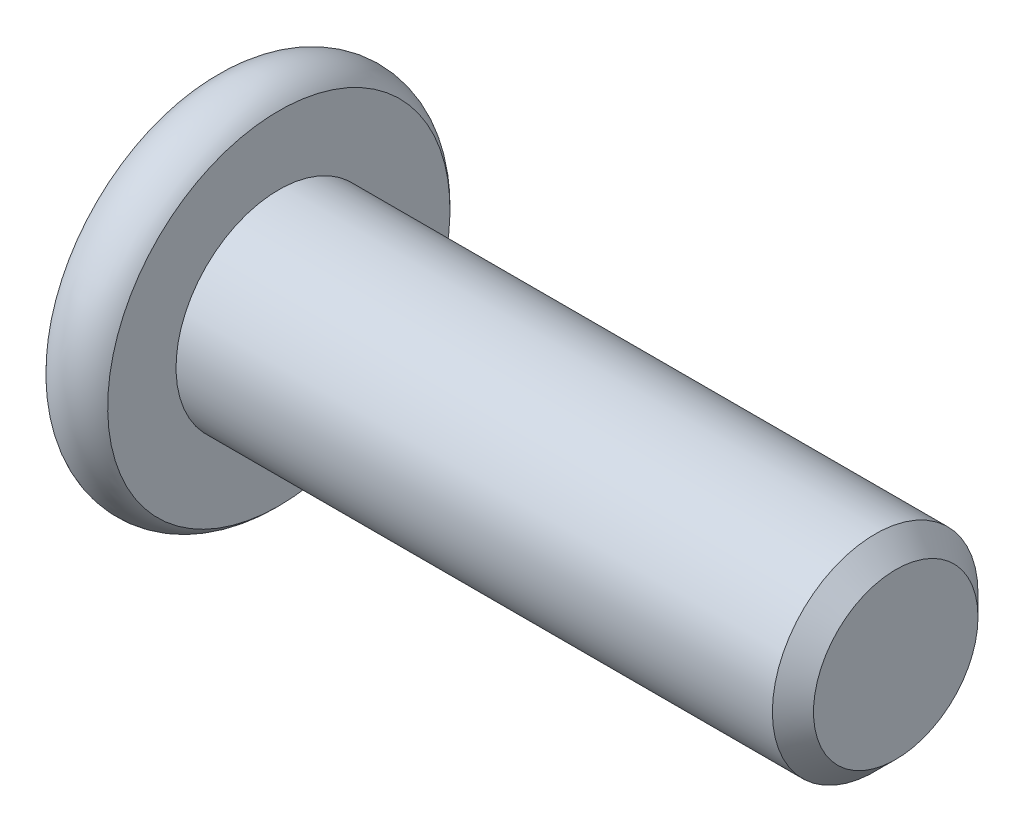
ISO-10303-21;
HEADER;
FILE_DESCRIPTION(('STEP AP214'),'2;1');
FILE_NAME('part.step','',(''),(''),'','','');
FILE_SCHEMA(('AUTOMOTIVE_DESIGN { 1 0 10303 214 1 1 1 1 }'));
ENDSEC;
DATA;
#1=APPLICATION_CONTEXT('core data for automotive mechanical design processes');
#2=APPLICATION_PROTOCOL_DEFINITION('international standard','automotive_design',2000,#1);
#3=PRODUCT_CONTEXT('',#1,'mechanical');
#4=PRODUCT('Part','Part','',(#3));
#5=PRODUCT_RELATED_PRODUCT_CATEGORY('part','',(#4));
#6=PRODUCT_DEFINITION_FORMATION('','',#4);
#7=PRODUCT_DEFINITION_CONTEXT('part definition',#1,'design');
#8=PRODUCT_DEFINITION('design','',#6,#7);
#9=PRODUCT_DEFINITION_SHAPE('','',#8);
#10=(LENGTH_UNIT() NAMED_UNIT(*) SI_UNIT(.MILLI.,.METRE.));
#11=(NAMED_UNIT(*) PLANE_ANGLE_UNIT() SI_UNIT($,.RADIAN.));
#12=(NAMED_UNIT(*) SI_UNIT($,.STERADIAN.) SOLID_ANGLE_UNIT());
#13=UNCERTAINTY_MEASURE_WITH_UNIT(LENGTH_MEASURE(1.E-05),#10,'distance_accuracy_value','');
#14=(GEOMETRIC_REPRESENTATION_CONTEXT(3) GLOBAL_UNCERTAINTY_ASSIGNED_CONTEXT((#13)) GLOBAL_UNIT_ASSIGNED_CONTEXT((#10,
#11,#12)) REPRESENTATION_CONTEXT('',''));
#15=CARTESIAN_POINT('',(0.,0.,0.));
#16=DIRECTION('',(0.,0.,1.));
#17=DIRECTION('',(1.,0.,0.));
#18=AXIS2_PLACEMENT_3D('',#15,#16,#17);
#19=CARTESIAN_POINT('',(-15.,0.,0.));
#20=DIRECTION('',(1.,0.,0.));
#21=DIRECTION('',(0.,0.,-1.));
#22=AXIS2_PLACEMENT_3D('',#19,#20,#21);
#23=CYLINDRICAL_SURFACE('',#22,2.5);
#24=CARTESIAN_POINT('',(-0.5,0.,0.));
#25=DIRECTION('',(1.,0.,0.));
#26=DIRECTION('',(0.,0.,-1.));
#27=AXIS2_PLACEMENT_3D('',#24,#25,#26);
#28=CIRCLE('',#27,2.5);
#29=CARTESIAN_POINT('',(-0.5,0.,-2.5));
#30=VERTEX_POINT('',#29);
#31=EDGE_CURVE('E45',#30,#30,#28,.F.);
#32=ORIENTED_EDGE('',*,*,#31,.T.);
#33=EDGE_LOOP('',(#32));
#34=FACE_BOUND('',#33,.T.);
#35=CARTESIAN_POINT('',(-15.,0.,0.));
#36=DIRECTION('',(-1.,0.,0.));
#37=DIRECTION('',(0.,-1.,0.));
#38=AXIS2_PLACEMENT_3D('',#35,#36,#37);
#39=CIRCLE('',#38,2.5);
#40=CARTESIAN_POINT('',(-15.,-2.50000000000001,0.));
#41=VERTEX_POINT('',#40);
#42=EDGE_CURVE('E121',#41,#41,#39,.F.);
#43=ORIENTED_EDGE('',*,*,#42,.T.);
#44=EDGE_LOOP('',(#43));
#45=FACE_BOUND('',#44,.T.);
#46=ADVANCED_FACE('F32',(#34,#45),#23,.T.);
#47=CARTESIAN_POINT('',(0.,0.,0.));
#48=DIRECTION('',(1.,0.,0.));
#49=DIRECTION('',(0.,0.,-1.));
#50=AXIS2_PLACEMENT_3D('',#47,#48,#49);
#51=PLANE('',#50);
#52=CARTESIAN_POINT('',(0.,0.,0.));
#53=DIRECTION('',(1.,0.,0.));
#54=DIRECTION('',(0.,0.,-1.));
#55=AXIS2_PLACEMENT_3D('',#52,#53,#54);
#56=CIRCLE('',#55,2.);
#57=CARTESIAN_POINT('',(0.,0.,-2.));
#58=VERTEX_POINT('',#57);
#59=EDGE_CURVE('E124',#58,#58,#56,.T.);
#60=ORIENTED_EDGE('',*,*,#59,.T.);
#61=EDGE_LOOP('',(#60));
#62=FACE_BOUND('',#61,.T.);
#63=ADVANCED_FACE('F134',(#62),#51,.T.);
#64=CARTESIAN_POINT('',(0.,0.,0.));
#65=DIRECTION('',(-1.,0.,0.));
#66=DIRECTION('',(0.,0.,1.));
#67=AXIS2_PLACEMENT_3D('',#64,#65,#66);
#68=CONICAL_SURFACE('',#67,2.,0.785398163397446);
#69=ORIENTED_EDGE('',*,*,#31,.F.);
#70=EDGE_LOOP('',(#69));
#71=FACE_BOUND('',#70,.T.);
#72=ORIENTED_EDGE('',*,*,#59,.F.);
#73=EDGE_LOOP('',(#72));
#74=FACE_BOUND('',#73,.T.);
#75=ADVANCED_FACE('F34',(#71,#74),#68,.T.);
#76=CARTESIAN_POINT('',(-16.5,0.,0.));
#77=DIRECTION('',(1.,0.,0.));
#78=DIRECTION('',(0.,1.,0.));
#79=AXIS2_PLACEMENT_3D('',#76,#77,#78);
#80=PLANE('',#79);
#81=CARTESIAN_POINT('',(-16.5,0.,0.));
#82=DIRECTION('',(-1.,0.,0.));
#83=DIRECTION('',(0.,-1.,0.));
#84=AXIS2_PLACEMENT_3D('',#81,#82,#83);
#85=CIRCLE('',#84,1.78205080756889);
#86=CARTESIAN_POINT('',(-16.5,-1.78205080756883,0.));
#87=VERTEX_POINT('',#86);
#88=EDGE_CURVE('E234',#87,#87,#85,.T.);
#89=ORIENTED_EDGE('',*,*,#88,.F.);
#90=EDGE_LOOP('',(#89));
#91=FACE_BOUND('',#90,.T.);
#92=CARTESIAN_POINT('',(-16.5,0.,0.));
#93=DIRECTION('',(-1.,0.,0.));
#94=DIRECTION('',(0.,-1.,0.));
#95=AXIS2_PLACEMENT_3D('',#92,#93,#94);
#96=CIRCLE('',#95,4.16143782776614);
#97=CARTESIAN_POINT('',(-16.5000000000001,-4.16143782776613,0.));
#98=VERTEX_POINT('',#97);
#99=EDGE_CURVE('E118',#98,#98,#96,.T.);
#100=ORIENTED_EDGE('',*,*,#99,.T.);
#101=EDGE_LOOP('',(#100));
#102=FACE_BOUND('',#101,.T.);
#103=ADVANCED_FACE('F133',(#91,#102),#80,.F.);
#104=CARTESIAN_POINT('',(-15.75,0.,0.));
#105=DIRECTION('',(-1.,0.,0.));
#106=DIRECTION('',(0.,-1.,0.));
#107=AXIS2_PLACEMENT_3D('',#104,#105,#106);
#108=TOROIDAL_SURFACE('',#107,3.49999999999999,1.);
#109=ORIENTED_EDGE('',*,*,#99,.F.);
#110=EDGE_LOOP('',(#109));
#111=FACE_BOUND('',#110,.T.);
#112=CARTESIAN_POINT('',(-15.,0.,0.));
#113=DIRECTION('',(-1.,0.,0.));
#114=DIRECTION('',(0.,-1.,0.));
#115=AXIS2_PLACEMENT_3D('',#112,#113,#114);
#116=CIRCLE('',#115,4.16143782776615);
#117=CARTESIAN_POINT('',(-15.0000000000001,-4.16143782776615,0.));
#118=VERTEX_POINT('',#117);
#119=EDGE_CURVE('E115',#118,#118,#116,.T.);
#120=ORIENTED_EDGE('',*,*,#119,.T.);
#121=EDGE_LOOP('',(#120));
#122=FACE_BOUND('',#121,.T.);
#123=ADVANCED_FACE('F145',(#111,#122),#108,.T.);
#124=CARTESIAN_POINT('',(-15.,4.16143782776615,0.));
#125=DIRECTION('',(-1.,0.,0.));
#126=DIRECTION('',(0.,-1.,0.));
#127=AXIS2_PLACEMENT_3D('',#124,#125,#126);
#128=PLANE('',#127);
#129=ORIENTED_EDGE('',*,*,#42,.F.);
#130=EDGE_LOOP('',(#129));
#131=FACE_BOUND('',#130,.T.);
#132=ORIENTED_EDGE('',*,*,#119,.F.);
#133=EDGE_LOOP('',(#132));
#134=FACE_BOUND('',#133,.T.);
#135=ADVANCED_FACE('F149',(#131,#134),#128,.F.);
#136=CARTESIAN_POINT('',(-16.5,0.,0.));
#137=DIRECTION('',(-1.,0.,0.));
#138=DIRECTION('',(0.,-1.,0.));
#139=AXIS2_PLACEMENT_3D('',#136,#137,#138);
#140=CONICAL_SURFACE('',#139,1.78205080756889,0.78539816339745);
#141=ORIENTED_EDGE('',*,*,#88,.T.);
#142=EDGE_LOOP('',(#141));
#143=FACE_BOUND('',#142,.T.);
#144=CARTESIAN_POINT('',(-17.015428085613,-1.74023253176578,1.5));
#145=CARTESIAN_POINT('',(-16.9833811073445,-1.69791724929731,1.5));
#146=CARTESIAN_POINT('',(-16.9516444672841,-1.65536760966792,1.5));
#147=CARTESIAN_POINT('',(-16.8889203936153,-1.56970398156685,1.5));
#148=CARTESIAN_POINT('',(-16.85793314822,-1.52658985542849,1.5));
#149=CARTESIAN_POINT('',(-16.765846164345,-1.39562626326563,1.5));
#150=CARTESIAN_POINT('',(-16.7061145123021,-1.30679868010576,1.5));
#151=CARTESIAN_POINT('',(-16.5887342891012,-1.12044622640215,1.5));
#152=CARTESIAN_POINT('',(-16.5314082774822,-1.02271587306672,1.5));
#153=CARTESIAN_POINT('',(-16.4264632149759,-0.822357214965248,1.5));
#154=CARTESIAN_POINT('',(-16.3788114236896,-0.71974693170191,1.5));
#155=CARTESIAN_POINT('',(-16.320509988315,-0.565852387095082,1.5));
#156=CARTESIAN_POINT('',(-16.3037990535409,-0.516874191424671,1.5));
#157=CARTESIAN_POINT('',(-16.2743077515089,-0.417723988457509,1.5));
#158=CARTESIAN_POINT('',(-16.2615276514219,-0.367551900263875,1.5));
#159=CARTESIAN_POINT('',(-16.2407784202458,-0.267158299056125,1.5));
#160=CARTESIAN_POINT('',(-16.2327260618259,-0.216954261864861,1.5));
#161=CARTESIAN_POINT('',(-16.221591636834,-0.115994915871326,1.5));
#162=CARTESIAN_POINT('',(-16.2185086886377,-0.0652397064615429,1.5));
#163=CARTESIAN_POINT('',(-16.2175473897404,0.0344222234875541,1.5));
#164=CARTESIAN_POINT('',(-16.2194789216951,0.0833271701100888,1.5));
#165=CARTESIAN_POINT('',(-16.2280175729676,0.180724293127223,1.5));
#166=CARTESIAN_POINT('',(-16.234625142048,0.229216429361731,1.5));
#167=CARTESIAN_POINT('',(-16.2522650626447,0.326258027697011,1.5));
#168=CARTESIAN_POINT('',(-16.2633731682009,0.374793507450031,1.5));
#169=CARTESIAN_POINT('',(-16.2894198669595,0.470802295834186,1.5));
#170=CARTESIAN_POINT('',(-16.3043581560035,0.518275688481289,1.5));
#171=CARTESIAN_POINT('',(-16.3568395457159,0.667150562065138,1.5));
#172=CARTESIAN_POINT('',(-16.4003351165442,0.766448362426857,1.5));
#173=CARTESIAN_POINT('',(-16.4970587814836,0.960384405673843,1.5));
#174=CARTESIAN_POINT('',(-16.5503217226674,1.05500437383622,1.5));
#175=CARTESIAN_POINT('',(-16.6602258010453,1.23584520321533,1.5));
#176=CARTESIAN_POINT('',(-16.7165682531046,1.3222498694655,1.5));
#177=CARTESIAN_POINT('',(-16.803675572597,1.44954953726474,1.5));
#178=CARTESIAN_POINT('',(-16.8330199906839,1.49143368482424,1.5));
#179=CARTESIAN_POINT('',(-16.892486918293,1.57462914783245,1.5));
#180=CARTESIAN_POINT('',(-16.9226092115007,1.6159406177258,1.5));
#181=CARTESIAN_POINT('',(-16.9530541181365,1.65701358742553,1.5));
#182=B_SPLINE_CURVE_WITH_KNOTS('',3,(#144,#145,#146,#147,#148,#149,#150,#151,#152,#153,#154,
#155,#156,#157,#158,#159,#160,#161,#162,#163,#164,#165,#166,#167,#168,#169,#170,#171,#172,#173,
#174,#175,#176,#177,#178,#179,#180,#181),.UNSPECIFIED.,.F.,.F.,(4,2,2,2,2,2,2,2,2,2,2,2,2,2,2,2,
2,2,4),(0.,0.159238974218355,0.318517535014548,0.639504781932397,0.979137893799214,
1.31760168934359,1.47272233841626,1.62785352839778,1.78016486537349,1.93244917778281,
2.079044862603,2.22565464958335,2.37484213303402,2.52401777304042,2.84828365283778,
3.17372975666753,3.4830303053054,3.63644667013911,3.78982082222915),.UNSPECIFIED.);
#183=CARTESIAN_POINT('',(-16.45,-0.866025403784376,1.5));
#184=VERTEX_POINT('',#183);
#185=CARTESIAN_POINT('',(-16.45,0.866025403784502,1.5));
#186=VERTEX_POINT('',#185);
#187=EDGE_CURVE('E99',#184,#186,#182,.T.);
#188=ORIENTED_EDGE('',*,*,#187,.F.);
#189=CARTESIAN_POINT('',(-16.4501154816001,-1.73216627762265,-0.000200000000000195));
#190=CARTESIAN_POINT('',(-16.4203654760673,-1.70239359975909,0.051367790737076));
#191=CARTESIAN_POINT('',(-16.3923624839103,-1.67212305186349,0.103797917665201));
#192=CARTESIAN_POINT('',(-16.3410892304401,-1.61039789003613,0.210709034055596));
#193=CARTESIAN_POINT('',(-16.3178475050444,-1.57893740312608,0.26520019581466));
#194=CARTESIAN_POINT('',(-16.2780337289922,-1.51549879897981,0.375079081357247));
#195=CARTESIAN_POINT('',(-16.2613615856709,-1.48353684526804,0.430438809095198));
#196=CARTESIAN_POINT('',(-16.2356744568181,-1.41890915196205,0.54237725747715));
#197=CARTESIAN_POINT('',(-16.2266402904789,-1.38624538781112,0.598952556553008));
#198=CARTESIAN_POINT('',(-16.2184890812269,-1.32995210095293,0.696455389516441));
#199=CARTESIAN_POINT('',(-16.2172822529892,-1.30639533311118,0.737256908280466));
#200=CARTESIAN_POINT('',(-16.2193140571623,-1.25932335290187,0.818787969615858));
#201=CARTESIAN_POINT('',(-16.2225536707483,-1.23580815085307,0.85951749431463));
#202=CARTESIAN_POINT('',(-16.233291985982,-1.1890041497842,0.940584402163416));
#203=CARTESIAN_POINT('',(-16.2407946530187,-1.16571558211713,0.980921384598288));
#204=CARTESIAN_POINT('',(-16.2596516119283,-1.11952932016329,1.06091833691403));
#205=CARTESIAN_POINT('',(-16.2710075570186,-1.0966317980878,1.10057800851621));
#206=CARTESIAN_POINT('',(-16.3047216475927,-1.03798159809692,1.20216313477448));
#207=CARTESIAN_POINT('',(-16.3296218490934,-1.00259267147459,1.26345855370969));
#208=CARTESIAN_POINT('',(-16.3716566532716,-0.950557780604313,1.35358562846331));
#209=CARTESIAN_POINT('',(-16.3864251535591,-0.933410759677086,1.38328513990772));
#210=CARTESIAN_POINT('',(-16.4173105659402,-0.899432101996345,1.44213790138375));
#211=CARTESIAN_POINT('',(-16.4334268341217,-0.882600319285648,1.47129140422064));
#212=CARTESIAN_POINT('',(-16.4501154816001,-0.865909933730538,1.5002));
#213=B_SPLINE_CURVE_WITH_KNOTS('',3,(#189,#190,#191,#192,#193,#194,#195,#196,#197,#198,#199,
#200,#201,#202,#203,#204,#205,#206,#207,#208,#209,#210,#211,#212),.UNSPECIFIED.,.F.,.F.,(4,2,2,
2,2,2,2,2,2,2,2,4),(0.,0.199829143693304,0.400822987382387,0.59862372053818,0.795926240188889,
0.937113067959881,1.07833105577193,1.21968061668222,1.36109089931054,1.58570969637565,
1.69770705470963,1.80965120737194),.UNSPECIFIED.);
#214=CARTESIAN_POINT('',(-16.45,-1.73205080756881,0.));
#215=VERTEX_POINT('',#214);
#216=EDGE_CURVE('E191',#215,#184,#213,.T.);
#217=ORIENTED_EDGE('',*,*,#216,.F.);
#218=CARTESIAN_POINT('',(-16.4501154816001,-0.865909933730537,-1.5002));
#219=CARTESIAN_POINT('',(-16.4203654760673,-0.895682611594102,-1.44863220926292));
#220=CARTESIAN_POINT('',(-16.3923624839103,-0.925953159489701,-1.3962020823348));
#221=CARTESIAN_POINT('',(-16.3410892304401,-0.98767832131706,-1.2892909659444));
#222=CARTESIAN_POINT('',(-16.3178475050444,-1.01913880822711,-1.23479980418534));
#223=CARTESIAN_POINT('',(-16.2780337289922,-1.08257741237338,-1.12492091864275));
#224=CARTESIAN_POINT('',(-16.2613615856709,-1.11453936608515,-1.0695611909048));
#225=CARTESIAN_POINT('',(-16.2356744568181,-1.17916705939114,-0.957622742522851));
#226=CARTESIAN_POINT('',(-16.2266402904789,-1.21183082354207,-0.901047443446993));
#227=CARTESIAN_POINT('',(-16.2184890812269,-1.26812411040026,-0.803544610483561));
#228=CARTESIAN_POINT('',(-16.2172822529892,-1.29168087824201,-0.762743091719536));
#229=CARTESIAN_POINT('',(-16.2193140571623,-1.33875285845132,-0.681212030384144));
#230=CARTESIAN_POINT('',(-16.2225536707483,-1.36226806050012,-0.640482505685372));
#231=CARTESIAN_POINT('',(-16.233291985982,-1.40907206156899,-0.559415597836586));
#232=CARTESIAN_POINT('',(-16.2407946530187,-1.43236062923606,-0.519078615401714));
#233=CARTESIAN_POINT('',(-16.2596516119283,-1.4785468911899,-0.439081663085971));
#234=CARTESIAN_POINT('',(-16.2710075570186,-1.50144441326539,-0.399421991483794));
#235=CARTESIAN_POINT('',(-16.3047216475927,-1.56009461325627,-0.297836865225517));
#236=CARTESIAN_POINT('',(-16.3296218490934,-1.5954835398786,-0.236541446290313));
#237=CARTESIAN_POINT('',(-16.3716566532716,-1.64751843074888,-0.146414371536688));
#238=CARTESIAN_POINT('',(-16.3864251535591,-1.66466545167611,-0.116714860092284));
#239=CARTESIAN_POINT('',(-16.4173105659402,-1.69864410935685,-0.0578620986162506));
#240=CARTESIAN_POINT('',(-16.4334268341217,-1.71547589206754,-0.028708595779364));
#241=CARTESIAN_POINT('',(-16.4501154816001,-1.73216627762265,0.000199999999999363));
#242=B_SPLINE_CURVE_WITH_KNOTS('',3,(#218,#219,#220,#221,#222,#223,#224,#225,#226,#227,#228,
#229,#230,#231,#232,#233,#234,#235,#236,#237,#238,#239,#240,#241),.UNSPECIFIED.,.F.,.F.,(4,2,2,
2,2,2,2,2,2,2,2,4),(0.,0.199829143693303,0.400822987382388,0.598623720538179,0.795926240188886,
0.937113067959878,1.07833105577192,1.21968061668222,1.36109089931054,1.58570969637565,
1.69770705470963,1.80965120737193),.UNSPECIFIED.);
#243=CARTESIAN_POINT('',(-16.45,-0.866025403784376,-1.5));
#244=VERTEX_POINT('',#243);
#245=EDGE_CURVE('E186',#244,#215,#242,.T.);
#246=ORIENTED_EDGE('',*,*,#245,.F.);
#247=CARTESIAN_POINT('',(-17.015428085613,-1.74023253176578,-1.5));
#248=CARTESIAN_POINT('',(-16.9833811073445,-1.69791724929731,-1.5));
#249=CARTESIAN_POINT('',(-16.9516444672841,-1.65536760966792,-1.5));
#250=CARTESIAN_POINT('',(-16.8889203936153,-1.56970398156685,-1.5));
#251=CARTESIAN_POINT('',(-16.85793314822,-1.52658985542849,-1.5));
#252=CARTESIAN_POINT('',(-16.765846164345,-1.39562626326563,-1.5));
#253=CARTESIAN_POINT('',(-16.7061145123021,-1.30679868010576,-1.5));
#254=CARTESIAN_POINT('',(-16.5887342891012,-1.12044622640215,-1.5));
#255=CARTESIAN_POINT('',(-16.5314082774822,-1.02271587306672,-1.5));
#256=CARTESIAN_POINT('',(-16.4264632149759,-0.822357214965248,-1.5));
#257=CARTESIAN_POINT('',(-16.3788114236896,-0.71974693170191,-1.5));
#258=CARTESIAN_POINT('',(-16.320509988315,-0.565852387095081,-1.5));
#259=CARTESIAN_POINT('',(-16.3037990535409,-0.51687419142467,-1.5));
#260=CARTESIAN_POINT('',(-16.2743077515089,-0.417723988457508,-1.5));
#261=CARTESIAN_POINT('',(-16.2615276514219,-0.367551900263874,-1.5));
#262=CARTESIAN_POINT('',(-16.2407784202458,-0.267158299056124,-1.5));
#263=CARTESIAN_POINT('',(-16.2327260618259,-0.216954261864859,-1.5));
#264=CARTESIAN_POINT('',(-16.221591636834,-0.115994915871324,-1.5));
#265=CARTESIAN_POINT('',(-16.2185086886377,-0.0652397064615412,-1.5));
#266=CARTESIAN_POINT('',(-16.2175473897404,0.0344222234875557,-1.5));
#267=CARTESIAN_POINT('',(-16.2194789216951,0.0833271701100905,-1.5));
#268=CARTESIAN_POINT('',(-16.2280175729676,0.180724293127224,-1.5));
#269=CARTESIAN_POINT('',(-16.234625142048,0.229216429361732,-1.5));
#270=CARTESIAN_POINT('',(-16.2522650626447,0.326258027697012,-1.5));
#271=CARTESIAN_POINT('',(-16.2633731682009,0.374793507450033,-1.5));
#272=CARTESIAN_POINT('',(-16.2894198669595,0.470802295834188,-1.5));
#273=CARTESIAN_POINT('',(-16.3043581560035,0.518275688481291,-1.5));
#274=CARTESIAN_POINT('',(-16.356839545716,0.667150562065141,-1.5));
#275=CARTESIAN_POINT('',(-16.4003351165442,0.76644836242686,-1.5));
#276=CARTESIAN_POINT('',(-16.4970587814836,0.960384405673847,-1.5));
#277=CARTESIAN_POINT('',(-16.5503217226674,1.05500437383622,-1.5));
#278=CARTESIAN_POINT('',(-16.6602258010453,1.23584520321533,-1.5));
#279=CARTESIAN_POINT('',(-16.7165682531046,1.32224986946551,-1.5));
#280=CARTESIAN_POINT('',(-16.803675572597,1.44954953726474,-1.5));
#281=CARTESIAN_POINT('',(-16.8330199906839,1.49143368482424,-1.5));
#282=CARTESIAN_POINT('',(-16.892486918293,1.57462914783245,-1.5));
#283=CARTESIAN_POINT('',(-16.9226092115007,1.6159406177258,-1.5));
#284=CARTESIAN_POINT('',(-16.9530541181365,1.65701358742554,-1.5));
#285=B_SPLINE_CURVE_WITH_KNOTS('',3,(#247,#248,#249,#250,#251,#252,#253,#254,#255,#256,#257,
#258,#259,#260,#261,#262,#263,#264,#265,#266,#267,#268,#269,#270,#271,#272,#273,#274,#275,#276,
#277,#278,#279,#280,#281,#282,#283,#284),.UNSPECIFIED.,.F.,.F.,(4,2,2,2,2,2,2,2,2,2,2,2,2,2,2,2,
2,2,4),(0.,0.159238974218354,0.318517535014547,0.639504781932396,0.979137893799212,
1.31760168934359,1.47272233841626,1.62785352839778,1.78016486537349,1.93244917778281,
2.079044862603,2.22565464958335,2.37484213303402,2.52401777304042,2.84828365283778,
3.17372975666753,3.4830303053054,3.63644667013911,3.78982082222915),.UNSPECIFIED.);
#286=CARTESIAN_POINT('',(-16.45,0.866025403784502,-1.5));
#287=VERTEX_POINT('',#286);
#288=EDGE_CURVE('E52',#287,#244,#285,.F.);
#289=ORIENTED_EDGE('',*,*,#288,.F.);
#290=CARTESIAN_POINT('',(-16.4501154816001,1.73216627762278,0.000200000000001006));
#291=CARTESIAN_POINT('',(-16.4203654760673,1.70239359975921,-0.0513677907370743));
#292=CARTESIAN_POINT('',(-16.3923624839103,1.67212305186361,-0.103797917665199));
#293=CARTESIAN_POINT('',(-16.3410892304401,1.61039789003626,-0.210709034055596));
#294=CARTESIAN_POINT('',(-16.3178475050444,1.5789374031262,-0.26520019581466));
#295=CARTESIAN_POINT('',(-16.2780337289922,1.51549879897993,-0.375079081357249));
#296=CARTESIAN_POINT('',(-16.2613615856709,1.48353684526816,-0.4304388090952));
#297=CARTESIAN_POINT('',(-16.2356744568181,1.41890915196217,-0.542377257477152));
#298=CARTESIAN_POINT('',(-16.2266402904789,1.38624538781124,-0.59895255655301));
#299=CARTESIAN_POINT('',(-16.2184890812268,1.32995210095306,-0.696455389516442));
#300=CARTESIAN_POINT('',(-16.2172822529892,1.3063953331113,-0.737256908280467));
#301=CARTESIAN_POINT('',(-16.2193140571623,1.259323352902,-0.818787969615859));
#302=CARTESIAN_POINT('',(-16.2225536707483,1.23580815085319,-0.859517494314631));
#303=CARTESIAN_POINT('',(-16.233291985982,1.18900414978433,-0.940584402163417));
#304=CARTESIAN_POINT('',(-16.2407946530187,1.16571558211726,-0.980921384598289));
#305=CARTESIAN_POINT('',(-16.2596516119283,1.11952932016341,-1.06091833691403));
#306=CARTESIAN_POINT('',(-16.2710075570186,1.09663179808792,-1.10057800851621));
#307=CARTESIAN_POINT('',(-16.3047216475927,1.03798159809705,-1.20216313477449));
#308=CARTESIAN_POINT('',(-16.3296218490934,1.00259267147472,-1.26345855370969));
#309=CARTESIAN_POINT('',(-16.3716566532716,0.950557780604437,-1.35358562846331));
#310=CARTESIAN_POINT('',(-16.3864251535591,0.93341075967721,-1.38328513990772));
#311=CARTESIAN_POINT('',(-16.4173105659402,0.899432101996469,-1.44213790138375));
#312=CARTESIAN_POINT('',(-16.4334268341217,0.882600319285772,-1.47129140422064));
#313=CARTESIAN_POINT('',(-16.4501154816001,0.865909933730663,-1.5002));
#314=B_SPLINE_CURVE_WITH_KNOTS('',3,(#290,#291,#292,#293,#294,#295,#296,#297,#298,#299,#300,
#301,#302,#303,#304,#305,#306,#307,#308,#309,#310,#311,#312,#313),.UNSPECIFIED.,.F.,.F.,(4,2,2,
2,2,2,2,2,2,2,2,4),(0.,0.199829143693305,0.40082298738239,0.598623720538184,0.795926240188893,
0.937113067959884,1.07833105577193,1.21968061668222,1.36109089931055,1.58570969637566,
1.69770705470964,1.80965120737194),.UNSPECIFIED.);
#315=CARTESIAN_POINT('',(-16.45,1.73205080756894,0.));
#316=VERTEX_POINT('',#315);
#317=EDGE_CURVE('E11',#316,#287,#314,.T.);
#318=ORIENTED_EDGE('',*,*,#317,.F.);
#319=CARTESIAN_POINT('',(-16.4501154816001,0.865909933730664,1.5002));
#320=CARTESIAN_POINT('',(-16.4203654760673,0.895682611594229,1.44863220926292));
#321=CARTESIAN_POINT('',(-16.3923624839103,0.925953159489828,1.3962020823348));
#322=CARTESIAN_POINT('',(-16.3410892304401,0.987678321317186,1.2892909659444));
#323=CARTESIAN_POINT('',(-16.3178475050444,1.01913880822724,1.23479980418534));
#324=CARTESIAN_POINT('',(-16.2780337289922,1.08257741237351,1.12492091864275));
#325=CARTESIAN_POINT('',(-16.2613615856709,1.11453936608528,1.0695611909048));
#326=CARTESIAN_POINT('',(-16.2356744568181,1.17916705939126,0.957622742522849));
#327=CARTESIAN_POINT('',(-16.2266402904789,1.21183082354219,0.901047443446991));
#328=CARTESIAN_POINT('',(-16.2184890812268,1.26812411040038,0.803544610483559));
#329=CARTESIAN_POINT('',(-16.2172822529892,1.29168087824214,0.762743091719533));
#330=CARTESIAN_POINT('',(-16.2193140571623,1.33875285845144,0.681212030384142));
#331=CARTESIAN_POINT('',(-16.2225536707483,1.36226806050024,0.64048250568537));
#332=CARTESIAN_POINT('',(-16.233291985982,1.40907206156911,0.559415597836584));
#333=CARTESIAN_POINT('',(-16.2407946530187,1.43236062923618,0.519078615401712));
#334=CARTESIAN_POINT('',(-16.2596516119283,1.47854689119003,0.439081663085969));
#335=CARTESIAN_POINT('',(-16.2710075570186,1.50144441326552,0.399421991483792));
#336=CARTESIAN_POINT('',(-16.3047216475927,1.56009461325639,0.297836865225516));
#337=CARTESIAN_POINT('',(-16.3296218490934,1.59548353987872,0.236541446290311));
#338=CARTESIAN_POINT('',(-16.3716566532716,1.647518430749,0.146414371536688));
#339=CARTESIAN_POINT('',(-16.3864251535591,1.66466545167623,0.116714860092284));
#340=CARTESIAN_POINT('',(-16.4173105659402,1.69864410935697,0.0578620986162506));
#341=CARTESIAN_POINT('',(-16.4334268341217,1.71547589206767,0.0287085957793642));
#342=CARTESIAN_POINT('',(-16.4501154816001,1.73216627762278,-0.000199999999999111));
#343=B_SPLINE_CURVE_WITH_KNOTS('',3,(#319,#320,#321,#322,#323,#324,#325,#326,#327,#328,#329,
#330,#331,#332,#333,#334,#335,#336,#337,#338,#339,#340,#341,#342),.UNSPECIFIED.,.F.,.F.,(4,2,2,
2,2,2,2,2,2,2,2,4),(0.,0.199829143693302,0.400822987382387,0.598623720538179,0.795926240188887,
0.937113067959879,1.07833105577193,1.21968061668222,1.36109089931054,1.58570969637565,
1.69770705470963,1.80965120737193),.UNSPECIFIED.);
#344=EDGE_CURVE('E90',#186,#316,#343,.T.);
#345=ORIENTED_EDGE('',*,*,#344,.F.);
#346=EDGE_LOOP('',(#188,#217,#246,#289,#318,#345));
#347=FACE_BOUND('',#346,.T.);
#348=ADVANCED_FACE('F89',(#143,#347),#140,.F.);
#349=CARTESIAN_POINT('',(-14.2,0.,0.));
#350=DIRECTION('',(-1.,0.,0.));
#351=DIRECTION('',(0.,-1.,0.));
#352=AXIS2_PLACEMENT_3D('',#349,#350,#351);
#353=PLANE('',#352);
#354=DIRECTION('',(0.,0.5,-0.866025403784439));
#355=VECTOR('',#354,1.);
#356=CARTESIAN_POINT('',(-14.2,0.866025403784493,1.5));
#357=LINE('',#356,#355);
#358=CARTESIAN_POINT('',(-14.2,0.866025403784493,1.5));
#359=VERTEX_POINT('',#358);
#360=CARTESIAN_POINT('',(-14.2,1.73205080756893,0.));
#361=VERTEX_POINT('',#360);
#362=EDGE_CURVE('E98',#359,#361,#357,.T.);
#363=ORIENTED_EDGE('',*,*,#362,.T.);
#364=DIRECTION('',(0.,-0.5,-0.866025403784439));
#365=VECTOR('',#364,1.);
#366=CARTESIAN_POINT('',(-14.2,1.73205080756893,0.));
#367=LINE('',#366,#365);
#368=CARTESIAN_POINT('',(-14.2,0.866025403784493,-1.5));
#369=VERTEX_POINT('',#368);
#370=EDGE_CURVE('E103',#361,#369,#367,.T.);
#371=ORIENTED_EDGE('',*,*,#370,.T.);
#372=DIRECTION('',(0.,-1.,0.));
#373=VECTOR('',#372,1.);
#374=CARTESIAN_POINT('',(-14.2,0.866025403784493,-1.5));
#375=LINE('',#374,#373);
#376=CARTESIAN_POINT('',(-14.2,-0.866025403784384,-1.5));
#377=VERTEX_POINT('',#376);
#378=EDGE_CURVE('E216',#369,#377,#375,.T.);
#379=ORIENTED_EDGE('',*,*,#378,.T.);
#380=DIRECTION('',(0.,-0.5,0.866025403784438));
#381=VECTOR('',#380,1.);
#382=CARTESIAN_POINT('',(-14.2,-0.866025403784384,-1.5));
#383=LINE('',#382,#381);
#384=CARTESIAN_POINT('',(-14.2,-1.73205080756882,0.));
#385=VERTEX_POINT('',#384);
#386=EDGE_CURVE('E220',#377,#385,#383,.T.);
#387=ORIENTED_EDGE('',*,*,#386,.T.);
#388=DIRECTION('',(0.,0.5,0.866025403784439));
#389=VECTOR('',#388,1.);
#390=CARTESIAN_POINT('',(-14.2,-1.73205080756882,0.));
#391=LINE('',#390,#389);
#392=CARTESIAN_POINT('',(-14.2,-0.866025403784385,1.5));
#393=VERTEX_POINT('',#392);
#394=EDGE_CURVE('E111',#385,#393,#391,.T.);
#395=ORIENTED_EDGE('',*,*,#394,.T.);
#396=DIRECTION('',(0.,1.,0.));
#397=VECTOR('',#396,1.);
#398=CARTESIAN_POINT('',(-14.2,-0.866025403784385,1.5));
#399=LINE('',#398,#397);
#400=EDGE_CURVE('E106',#393,#359,#399,.T.);
#401=ORIENTED_EDGE('',*,*,#400,.T.);
#402=EDGE_LOOP('',(#363,#371,#379,#387,#395,#401));
#403=FACE_BOUND('',#402,.T.);
#404=ADVANCED_FACE('F173',(#403),#353,.T.);
#405=CARTESIAN_POINT('',(-14.2,1.73205080756893,0.));
#406=DIRECTION('',(0.,0.866025403784439,-0.5));
#407=DIRECTION('',(0.,0.5,0.866025403784439));
#408=AXIS2_PLACEMENT_3D('',#405,#406,#407);
#409=PLANE('',#408);
#410=DIRECTION('',(-1.,0.,0.));
#411=VECTOR('',#410,1.);
#412=CARTESIAN_POINT('',(-14.2,1.73205080756893,0.));
#413=LINE('',#412,#411);
#414=EDGE_CURVE('E96',#361,#316,#413,.T.);
#415=ORIENTED_EDGE('',*,*,#414,.T.);
#416=ORIENTED_EDGE('',*,*,#317,.T.);
#417=DIRECTION('',(-1.,0.,0.));
#418=VECTOR('',#417,1.);
#419=CARTESIAN_POINT('',(-14.2,0.866025403784493,-1.5));
#420=LINE('',#419,#418);
#421=EDGE_CURVE('E105',#369,#287,#420,.T.);
#422=ORIENTED_EDGE('',*,*,#421,.F.);
#423=ORIENTED_EDGE('',*,*,#370,.F.);
#424=EDGE_LOOP('',(#415,#416,#422,#423));
#425=FACE_BOUND('',#424,.T.);
#426=ADVANCED_FACE('F101',(#425),#409,.F.);
#427=CARTESIAN_POINT('',(-14.2,0.866025403784493,-1.5));
#428=DIRECTION('',(0.,0.,-1.));
#429=DIRECTION('',(-1.,0.,0.));
#430=AXIS2_PLACEMENT_3D('',#427,#428,#429);
#431=PLANE('',#430);
#432=ORIENTED_EDGE('',*,*,#421,.T.);
#433=ORIENTED_EDGE('',*,*,#288,.T.);
#434=DIRECTION('',(-1.,0.,0.));
#435=VECTOR('',#434,1.);
#436=CARTESIAN_POINT('',(-14.2,-0.866025403784384,-1.5));
#437=LINE('',#436,#435);
#438=EDGE_CURVE('E108',#377,#244,#437,.T.);
#439=ORIENTED_EDGE('',*,*,#438,.F.);
#440=ORIENTED_EDGE('',*,*,#378,.F.);
#441=EDGE_LOOP('',(#432,#433,#439,#440));
#442=FACE_BOUND('',#441,.T.);
#443=ADVANCED_FACE('F205',(#442),#431,.F.);
#444=CARTESIAN_POINT('',(-14.2,-0.866025403784384,-1.5));
#445=DIRECTION('',(0.,-0.866025403784438,-0.5));
#446=DIRECTION('',(0.,0.5,-0.866025403784438));
#447=AXIS2_PLACEMENT_3D('',#444,#445,#446);
#448=PLANE('',#447);
#449=ORIENTED_EDGE('',*,*,#438,.T.);
#450=ORIENTED_EDGE('',*,*,#245,.T.);
#451=DIRECTION('',(-1.,0.,0.));
#452=VECTOR('',#451,1.);
#453=CARTESIAN_POINT('',(-14.2,-1.73205080756882,0.));
#454=LINE('',#453,#452);
#455=EDGE_CURVE('E230',#385,#215,#454,.T.);
#456=ORIENTED_EDGE('',*,*,#455,.F.);
#457=ORIENTED_EDGE('',*,*,#386,.F.);
#458=EDGE_LOOP('',(#449,#450,#456,#457));
#459=FACE_BOUND('',#458,.T.);
#460=ADVANCED_FACE('F200',(#459),#448,.F.);
#461=CARTESIAN_POINT('',(-14.2,-1.73205080756882,0.));
#462=DIRECTION('',(0.,-0.866025403784439,0.5));
#463=DIRECTION('',(0.,-0.5,-0.866025403784439));
#464=AXIS2_PLACEMENT_3D('',#461,#462,#463);
#465=PLANE('',#464);
#466=ORIENTED_EDGE('',*,*,#455,.T.);
#467=ORIENTED_EDGE('',*,*,#216,.T.);
#468=DIRECTION('',(-1.,0.,0.));
#469=VECTOR('',#468,1.);
#470=CARTESIAN_POINT('',(-14.2,-0.866025403784385,1.5));
#471=LINE('',#470,#469);
#472=EDGE_CURVE('E227',#393,#184,#471,.T.);
#473=ORIENTED_EDGE('',*,*,#472,.F.);
#474=ORIENTED_EDGE('',*,*,#394,.F.);
#475=EDGE_LOOP('',(#466,#467,#473,#474));
#476=FACE_BOUND('',#475,.T.);
#477=ADVANCED_FACE('F197',(#476),#465,.F.);
#478=CARTESIAN_POINT('',(-14.2,-0.866025403784385,1.5));
#479=DIRECTION('',(0.,0.,1.));
#480=DIRECTION('',(1.,0.,0.));
#481=AXIS2_PLACEMENT_3D('',#478,#479,#480);
#482=PLANE('',#481);
#483=ORIENTED_EDGE('',*,*,#472,.T.);
#484=ORIENTED_EDGE('',*,*,#187,.T.);
#485=DIRECTION('',(-1.,0.,0.));
#486=VECTOR('',#485,1.);
#487=CARTESIAN_POINT('',(-14.2,0.866025403784493,1.5));
#488=LINE('',#487,#486);
#489=EDGE_CURVE('E59',#359,#186,#488,.T.);
#490=ORIENTED_EDGE('',*,*,#489,.F.);
#491=ORIENTED_EDGE('',*,*,#400,.F.);
#492=EDGE_LOOP('',(#483,#484,#490,#491));
#493=FACE_BOUND('',#492,.T.);
#494=ADVANCED_FACE('F156',(#493),#482,.F.);
#495=CARTESIAN_POINT('',(-14.2,0.866025403784493,1.5));
#496=DIRECTION('',(0.,0.866025403784439,0.5));
#497=DIRECTION('',(0.,-0.5,0.866025403784439));
#498=AXIS2_PLACEMENT_3D('',#495,#496,#497);
#499=PLANE('',#498);
#500=ORIENTED_EDGE('',*,*,#489,.T.);
#501=ORIENTED_EDGE('',*,*,#344,.T.);
#502=ORIENTED_EDGE('',*,*,#414,.F.);
#503=ORIENTED_EDGE('',*,*,#362,.F.);
#504=EDGE_LOOP('',(#500,#501,#502,#503));
#505=FACE_BOUND('',#504,.T.);
#506=ADVANCED_FACE('F95',(#505),#499,.F.);
#507=CLOSED_SHELL('',(#46,#63,#75,#103,#123,#135,#348,#404,#426,#443,#460,#477,#494,#506));
#508=MANIFOLD_SOLID_BREP('B2',#507);
#509=ADVANCED_BREP_SHAPE_REPRESENTATION('',(#18,#508),#14);
#510=SHAPE_DEFINITION_REPRESENTATION(#9,#509);
ENDSEC;
END-ISO-10303-21;
